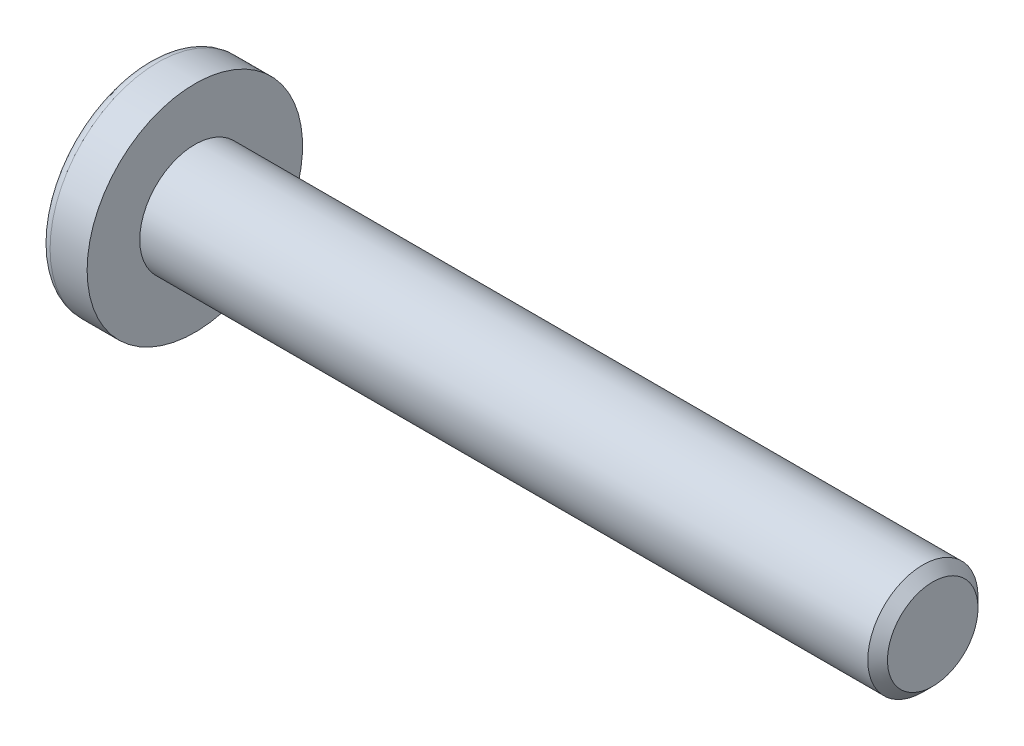
ISO-10303-21;
HEADER;
FILE_DESCRIPTION(('STEP AP214'),'2;1');
FILE_NAME('part.step','',(''),(''),'','','');
FILE_SCHEMA(('AUTOMOTIVE_DESIGN { 1 0 10303 214 1 1 1 1 }'));
ENDSEC;
DATA;
#1=APPLICATION_CONTEXT('core data for automotive mechanical design processes');
#2=APPLICATION_PROTOCOL_DEFINITION('international standard','automotive_design',2000,#1);
#3=PRODUCT_CONTEXT('',#1,'mechanical');
#4=PRODUCT('Part','Part','',(#3));
#5=PRODUCT_RELATED_PRODUCT_CATEGORY('part','',(#4));
#6=PRODUCT_DEFINITION_FORMATION('','',#4);
#7=PRODUCT_DEFINITION_CONTEXT('part definition',#1,'design');
#8=PRODUCT_DEFINITION('design','',#6,#7);
#9=PRODUCT_DEFINITION_SHAPE('','',#8);
#10=(LENGTH_UNIT() NAMED_UNIT(*) SI_UNIT(.MILLI.,.METRE.));
#11=(NAMED_UNIT(*) PLANE_ANGLE_UNIT() SI_UNIT($,.RADIAN.));
#12=(NAMED_UNIT(*) SI_UNIT($,.STERADIAN.) SOLID_ANGLE_UNIT());
#13=UNCERTAINTY_MEASURE_WITH_UNIT(LENGTH_MEASURE(1.E-05),#10,'distance_accuracy_value','');
#14=(GEOMETRIC_REPRESENTATION_CONTEXT(3) GLOBAL_UNCERTAINTY_ASSIGNED_CONTEXT((#13)) GLOBAL_UNIT_ASSIGNED_CONTEXT((#10,
#11,#12)) REPRESENTATION_CONTEXT('',''));
#15=CARTESIAN_POINT('',(0.,0.,0.));
#16=DIRECTION('',(0.,0.,1.));
#17=DIRECTION('',(1.,0.,0.));
#18=AXIS2_PLACEMENT_3D('',#15,#16,#17);
#19=CARTESIAN_POINT('',(4.55168,0.,0.));
#20=DIRECTION('',(-1.,0.,0.));
#21=DIRECTION('',(0.,1.,0.));
#22=AXIS2_PLACEMENT_3D('',#19,#20,#21);
#23=SPHERICAL_SURFACE('',#22,4.55168);
#24=CARTESIAN_POINT('',(0.870207289833468,0.,0.));
#25=DIRECTION('',(-1.,0.,0.));
#26=DIRECTION('',(0.,0.,1.));
#27=AXIS2_PLACEMENT_3D('',#24,#25,#26);
#28=CIRCLE('',#27,2.67666761229314);
#29=CARTESIAN_POINT('',(0.870207289833468,0.,2.67666761229314));
#30=VERTEX_POINT('',#29);
#31=EDGE_CURVE('E149',#30,#30,#28,.T.);
#32=ORIENTED_EDGE('',*,*,#31,.T.);
#33=EDGE_LOOP('',(#32));
#34=FACE_BOUND('',#33,.T.);
#35=CARTESIAN_POINT('',(4.54621406502776,-0.053976107850912,0.));
#36=DIRECTION('',(-0.100750553686815,-0.9949117176573,0.));
#37=DIRECTION('',(0.994911717657301,-0.100750553686815,0.));
#38=AXIS2_PLACEMENT_3D('',#35,#36,#37);
#39=CIRCLE('',#38,4.55135666870178);
#40=CARTESIAN_POINT('',(0.298280104214869,0.376194419826337,1.57634320737159));
#41=VERTEX_POINT('',#40);
#42=CARTESIAN_POINT('',(0.0357821905509195,0.402776487032817,0.402776487032818));
#43=VERTEX_POINT('',#42);
#44=EDGE_CURVE('E259',#41,#43,#39,.T.);
#45=ORIENTED_EDGE('',*,*,#44,.F.);
#46=CARTESIAN_POINT('',(3.65196023945684,0.,-1.11933639500645));
#47=DIRECTION('',(0.626498155753381,0.,0.77942290243334));
#48=DIRECTION('',(0.77942290243334,0.,-0.626498155753381));
#49=AXIS2_PLACEMENT_3D('',#46,#47,#48);
#50=CIRCLE('',#49,4.31918756361681);
#51=CARTESIAN_POINT('',(0.298280104214869,-0.376194419826348,1.57634320737159));
#52=VERTEX_POINT('',#51);
#53=EDGE_CURVE('E148',#41,#52,#50,.T.);
#54=ORIENTED_EDGE('',*,*,#53,.T.);
#55=CARTESIAN_POINT('',(4.54621406502776,0.0539761078509117,0.));
#56=DIRECTION('',(-0.100750553686815,0.9949117176573,0.));
#57=DIRECTION('',(-0.994911717657301,-0.100750553686815,0.));
#58=AXIS2_PLACEMENT_3D('',#55,#56,#57);
#59=CIRCLE('',#58,4.55135666870178);
#60=CARTESIAN_POINT('',(0.0357821905509186,-0.402776487032819,0.402776487032818));
#61=VERTEX_POINT('',#60);
#62=EDGE_CURVE('E104',#61,#52,#59,.T.);
#63=ORIENTED_EDGE('',*,*,#62,.F.);
#64=CARTESIAN_POINT('',(4.54621406502776,0.,-0.0539761078509118));
#65=DIRECTION('',(-0.100750553686815,0.,-0.9949117176573));
#66=DIRECTION('',(-0.994911717657301,0.,0.100750553686815));
#67=AXIS2_PLACEMENT_3D('',#64,#65,#66);
#68=CIRCLE('',#67,4.55135666870178);
#69=CARTESIAN_POINT('',(0.298280104214869,-1.57634320737159,0.376194419826342));
#70=VERTEX_POINT('',#69);
#71=EDGE_CURVE('E129',#70,#61,#68,.T.);
#72=ORIENTED_EDGE('',*,*,#71,.F.);
#73=CARTESIAN_POINT('',(3.65196023945684,1.11933639500645,0.));
#74=DIRECTION('',(0.626498155753381,-0.779422902433341,0.));
#75=DIRECTION('',(0.779422902433341,0.626498155753381,0.));
#76=AXIS2_PLACEMENT_3D('',#73,#74,#75);
#77=CIRCLE('',#76,4.31918756361681);
#78=CARTESIAN_POINT('',(0.298280104214869,-1.57634320737159,-0.376194419826342));
#79=VERTEX_POINT('',#78);
#80=EDGE_CURVE('E137',#70,#79,#77,.T.);
#81=ORIENTED_EDGE('',*,*,#80,.T.);
#82=CARTESIAN_POINT('',(4.54621406502776,0.,0.0539761078509119));
#83=DIRECTION('',(-0.100750553686815,0.,0.9949117176573));
#84=DIRECTION('',(0.994911717657301,0.,0.100750553686815));
#85=AXIS2_PLACEMENT_3D('',#82,#83,#84);
#86=CIRCLE('',#85,4.55135666870178);
#87=CARTESIAN_POINT('',(0.0357821905509195,-0.402776487032816,-0.402776487032818));
#88=VERTEX_POINT('',#87);
#89=EDGE_CURVE('E45',#88,#79,#86,.T.);
#90=ORIENTED_EDGE('',*,*,#89,.F.);
#91=CARTESIAN_POINT('',(0.298280104214869,-0.376194419826336,-1.57634320737159));
#92=VERTEX_POINT('',#91);
#93=EDGE_CURVE('E254',#92,#88,#59,.T.);
#94=ORIENTED_EDGE('',*,*,#93,.F.);
#95=CARTESIAN_POINT('',(3.65196023945684,0.,1.11933639500645));
#96=DIRECTION('',(0.626498155753381,0.,-0.779422902433341));
#97=DIRECTION('',(-0.779422902433341,0.,-0.626498155753381));
#98=AXIS2_PLACEMENT_3D('',#95,#96,#97);
#99=CIRCLE('',#98,4.31918756361681);
#100=CARTESIAN_POINT('',(0.298280104214869,0.376194419826348,-1.57634320737159));
#101=VERTEX_POINT('',#100);
#102=EDGE_CURVE('E130',#92,#101,#99,.T.);
#103=ORIENTED_EDGE('',*,*,#102,.T.);
#104=CARTESIAN_POINT('',(0.0357821905509195,0.40277648703282,-0.402776487032818));
#105=VERTEX_POINT('',#104);
#106=EDGE_CURVE('E264',#105,#101,#39,.T.);
#107=ORIENTED_EDGE('',*,*,#106,.F.);
#108=CARTESIAN_POINT('',(0.29828010421487,1.57634320737159,-0.376194419826342));
#109=VERTEX_POINT('',#108);
#110=EDGE_CURVE('E165',#109,#105,#86,.T.);
#111=ORIENTED_EDGE('',*,*,#110,.F.);
#112=CARTESIAN_POINT('',(3.65196023945684,-1.11933639500645,0.));
#113=DIRECTION('',(0.626498155753381,0.77942290243334,0.));
#114=DIRECTION('',(-0.77942290243334,0.626498155753381,0.));
#115=AXIS2_PLACEMENT_3D('',#112,#113,#114);
#116=CIRCLE('',#115,4.31918756361681);
#117=CARTESIAN_POINT('',(0.29828010421487,1.57634320737159,0.376194419826342));
#118=VERTEX_POINT('',#117);
#119=EDGE_CURVE('E53',#109,#118,#116,.T.);
#120=ORIENTED_EDGE('',*,*,#119,.T.);
#121=EDGE_CURVE('E163',#43,#118,#68,.T.);
#122=ORIENTED_EDGE('',*,*,#121,.F.);
#123=EDGE_LOOP('',(#45,#54,#63,#72,#81,#90,#94,#103,#107,#111,#120,#122));
#124=FACE_BOUND('',#123,.T.);
#125=ADVANCED_FACE('F30',(#34,#124),#23,.T.);
#126=CARTESIAN_POINT('',(2.2594,0.,-0.1776));
#127=DIRECTION('',(-0.100750553686815,0.,0.9949117176573));
#128=DIRECTION('',(0.994911717657301,0.,0.100750553686815));
#129=AXIS2_PLACEMENT_3D('',#126,#127,#128);
#130=PLANE('',#129);
#131=ORIENTED_EDGE('',*,*,#110,.T.);
#132=DIRECTION('',(0.989900325021556,-0.100243070888259,0.100243070888259));
#133=VECTOR('',#132,1.);
#134=CARTESIAN_POINT('',(2.27702336316533,0.175815355628828,-0.175815355628827));
#135=LINE('',#134,#133);
#136=CARTESIAN_POINT('',(2.0066,0.203200000000001,-0.203199999999999));
#137=VERTEX_POINT('',#136);
#138=EDGE_CURVE('E262',#105,#137,#135,.T.);
#139=ORIENTED_EDGE('',*,*,#138,.T.);
#140=DIRECTION('',(0.777006374114706,-0.624555756408657,0.0786841897837677));
#141=VECTOR('',#140,1.);
#142=CARTESIAN_POINT('',(0.,1.8161,-0.4064));
#143=LINE('',#142,#141);
#144=EDGE_CURVE('E153',#109,#137,#143,.T.);
#145=ORIENTED_EDGE('',*,*,#144,.F.);
#146=EDGE_LOOP('',(#131,#139,#145));
#147=FACE_BOUND('',#146,.T.);
#148=ADVANCED_FACE('F184',(#147),#130,.T.);
#149=DIRECTION('',(0.777006374114707,0.624555756408656,0.0786841897837678));
#150=VECTOR('',#149,1.);
#151=CARTESIAN_POINT('',(0.,-1.8161,-0.4064));
#152=LINE('',#151,#150);
#153=CARTESIAN_POINT('',(2.0066,-0.2032,-0.2032));
#154=VERTEX_POINT('',#153);
#155=EDGE_CURVE('E138',#79,#154,#152,.T.);
#156=ORIENTED_EDGE('',*,*,#155,.T.);
#157=DIRECTION('',(-0.989900325021556,-0.100243070888258,-0.100243070888259));
#158=VECTOR('',#157,1.);
#159=CARTESIAN_POINT('',(2.27702336316533,-0.175815355628826,-0.175815355628827));
#160=LINE('',#159,#158);
#161=EDGE_CURVE('E250',#154,#88,#160,.T.);
#162=ORIENTED_EDGE('',*,*,#161,.T.);
#163=ORIENTED_EDGE('',*,*,#89,.T.);
#164=EDGE_LOOP('',(#156,#162,#163));
#165=FACE_BOUND('',#164,.T.);
#166=ADVANCED_FACE('F190',(#165),#130,.T.);
#167=CARTESIAN_POINT('',(2.2594,0.,0.1776));
#168=DIRECTION('',(-0.100750553686815,0.,-0.9949117176573));
#169=DIRECTION('',(-0.994911717657301,0.,0.100750553686815));
#170=AXIS2_PLACEMENT_3D('',#167,#168,#169);
#171=PLANE('',#170);
#172=DIRECTION('',(0.777006374114706,-0.624555756408657,-0.0786841897837677));
#173=VECTOR('',#172,1.);
#174=CARTESIAN_POINT('',(0.,1.8161,0.4064));
#175=LINE('',#174,#173);
#176=CARTESIAN_POINT('',(2.0066,0.2032,0.2032));
#177=VERTEX_POINT('',#176);
#178=EDGE_CURVE('E243',#118,#177,#175,.T.);
#179=ORIENTED_EDGE('',*,*,#178,.T.);
#180=DIRECTION('',(-0.989900325021556,0.100243070888259,0.100243070888259));
#181=VECTOR('',#180,1.);
#182=CARTESIAN_POINT('',(2.27702336316533,0.175815355628826,0.175815355628827));
#183=LINE('',#182,#181);
#184=EDGE_CURVE('E256',#177,#43,#183,.T.);
#185=ORIENTED_EDGE('',*,*,#184,.T.);
#186=ORIENTED_EDGE('',*,*,#121,.T.);
#187=EDGE_LOOP('',(#179,#185,#186));
#188=FACE_BOUND('',#187,.T.);
#189=ADVANCED_FACE('F213',(#188),#171,.T.);
#190=ORIENTED_EDGE('',*,*,#71,.T.);
#191=DIRECTION('',(0.989900325021556,0.100243070888259,-0.100243070888259));
#192=VECTOR('',#191,1.);
#193=CARTESIAN_POINT('',(2.27702336316533,-0.175815355628828,0.175815355628827));
#194=LINE('',#193,#192);
#195=CARTESIAN_POINT('',(2.0066,-0.203200000000001,0.203199999999999));
#196=VERTEX_POINT('',#195);
#197=EDGE_CURVE('E102',#61,#196,#194,.T.);
#198=ORIENTED_EDGE('',*,*,#197,.T.);
#199=DIRECTION('',(0.777006374114707,0.624555756408656,-0.0786841897837676));
#200=VECTOR('',#199,1.);
#201=CARTESIAN_POINT('',(0.,-1.8161,0.406399999999999));
#202=LINE('',#201,#200);
#203=EDGE_CURVE('E127',#70,#196,#202,.T.);
#204=ORIENTED_EDGE('',*,*,#203,.F.);
#205=EDGE_LOOP('',(#190,#198,#204));
#206=FACE_BOUND('',#205,.T.);
#207=ADVANCED_FACE('F126',(#206),#171,.T.);
#208=CARTESIAN_POINT('',(-25.4,0.,0.));
#209=DIRECTION('',(-1.,0.,0.));
#210=DIRECTION('',(0.,0.,1.));
#211=AXIS2_PLACEMENT_3D('',#208,#209,#210);
#212=CYLINDRICAL_SURFACE('',#211,1.4224);
#213=CARTESIAN_POINT('',(20.828,0.,0.));
#214=DIRECTION('',(1.,0.,0.));
#215=DIRECTION('',(0.,0.,-1.));
#216=AXIS2_PLACEMENT_3D('',#213,#214,#215);
#217=CIRCLE('',#216,1.4224);
#218=CARTESIAN_POINT('',(20.828,0.,-1.4224));
#219=VERTEX_POINT('',#218);
#220=EDGE_CURVE('E38',#219,#219,#217,.F.);
#221=ORIENTED_EDGE('',*,*,#220,.T.);
#222=EDGE_LOOP('',(#221));
#223=FACE_BOUND('',#222,.T.);
#224=CARTESIAN_POINT('',(2.032,0.,0.));
#225=DIRECTION('',(-1.,0.,0.));
#226=DIRECTION('',(0.,0.,1.));
#227=AXIS2_PLACEMENT_3D('',#224,#225,#226);
#228=CIRCLE('',#227,1.4224);
#229=CARTESIAN_POINT('',(2.032,0.,1.4224));
#230=VERTEX_POINT('',#229);
#231=EDGE_CURVE('E159',#230,#230,#228,.T.);
#232=ORIENTED_EDGE('',*,*,#231,.F.);
#233=EDGE_LOOP('',(#232));
#234=FACE_BOUND('',#233,.T.);
#235=ADVANCED_FACE('F171',(#223,#234),#212,.T.);
#236=CARTESIAN_POINT('',(2.032,1.4224,0.));
#237=DIRECTION('',(-1.,0.,0.));
#238=DIRECTION('',(0.,0.,1.));
#239=AXIS2_PLACEMENT_3D('',#236,#237,#238);
#240=PLANE('',#239);
#241=CARTESIAN_POINT('',(2.032,0.,0.));
#242=DIRECTION('',(-1.,0.,0.));
#243=DIRECTION('',(0.,0.,1.));
#244=AXIS2_PLACEMENT_3D('',#241,#242,#243);
#245=CIRCLE('',#244,2.7813);
#246=CARTESIAN_POINT('',(2.032,0.,2.7813));
#247=VERTEX_POINT('',#246);
#248=EDGE_CURVE('E156',#247,#247,#245,.T.);
#249=ORIENTED_EDGE('',*,*,#248,.F.);
#250=EDGE_LOOP('',(#249));
#251=FACE_BOUND('',#250,.T.);
#252=ORIENTED_EDGE('',*,*,#231,.T.);
#253=EDGE_LOOP('',(#252));
#254=FACE_BOUND('',#253,.T.);
#255=ADVANCED_FACE('F205',(#251,#254),#240,.F.);
#256=CARTESIAN_POINT('',(-25.4,0.,0.));
#257=DIRECTION('',(-1.,0.,0.));
#258=DIRECTION('',(0.,0.,1.));
#259=AXIS2_PLACEMENT_3D('',#256,#257,#258);
#260=CYLINDRICAL_SURFACE('',#259,2.7813);
#261=ORIENTED_EDGE('',*,*,#248,.T.);
#262=EDGE_LOOP('',(#261));
#263=FACE_BOUND('',#262,.T.);
#264=CARTESIAN_POINT('',(1.07564661517758,0.,0.));
#265=DIRECTION('',(-1.,0.,0.));
#266=DIRECTION('',(0.,0.,1.));
#267=AXIS2_PLACEMENT_3D('',#264,#265,#266);
#268=CIRCLE('',#267,2.7813);
#269=CARTESIAN_POINT('',(1.07564661517758,0.,2.7813));
#270=VERTEX_POINT('',#269);
#271=EDGE_CURVE('E152',#270,#270,#268,.T.);
#272=ORIENTED_EDGE('',*,*,#271,.F.);
#273=EDGE_LOOP('',(#272));
#274=FACE_BOUND('',#273,.T.);
#275=ADVANCED_FACE('F201',(#263,#274),#260,.T.);
#276=CARTESIAN_POINT('',(1.07564661517758,0.,0.));
#277=DIRECTION('',(-1.,0.,0.));
#278=DIRECTION('',(0.,0.,1.));
#279=AXIS2_PLACEMENT_3D('',#276,#277,#278);
#280=TOROIDAL_SURFACE('',#279,2.5273,0.254);
#281=ORIENTED_EDGE('',*,*,#271,.T.);
#282=EDGE_LOOP('',(#281));
#283=FACE_BOUND('',#282,.T.);
#284=ORIENTED_EDGE('',*,*,#31,.F.);
#285=EDGE_LOOP('',(#284));
#286=FACE_BOUND('',#285,.T.);
#287=ADVANCED_FACE('F198',(#283,#286),#280,.T.);
#288=CARTESIAN_POINT('',(21.082,1.4224,0.));
#289=DIRECTION('',(1.,0.,0.));
#290=DIRECTION('',(0.,0.,-1.));
#291=AXIS2_PLACEMENT_3D('',#288,#289,#290);
#292=PLANE('',#291);
#293=CARTESIAN_POINT('',(21.082,0.,0.));
#294=DIRECTION('',(1.,0.,0.));
#295=DIRECTION('',(0.,0.,-1.));
#296=AXIS2_PLACEMENT_3D('',#293,#294,#295);
#297=CIRCLE('',#296,1.1684);
#298=CARTESIAN_POINT('',(21.082,0.,-1.1684));
#299=VERTEX_POINT('',#298);
#300=EDGE_CURVE('E11',#299,#299,#297,.T.);
#301=ORIENTED_EDGE('',*,*,#300,.T.);
#302=EDGE_LOOP('',(#301));
#303=FACE_BOUND('',#302,.T.);
#304=ADVANCED_FACE('F196',(#303),#292,.T.);
#305=CARTESIAN_POINT('',(2.0066,0.2032,0.2032));
#306=DIRECTION('',(0.626498155753381,0.77942290243334,0.));
#307=DIRECTION('',(-0.77942290243334,0.626498155753381,0.));
#308=AXIS2_PLACEMENT_3D('',#305,#306,#307);
#309=PLANE('',#308);
#310=ORIENTED_EDGE('',*,*,#144,.T.);
#311=DIRECTION('',(0.,0.,-1.));
#312=VECTOR('',#311,1.);
#313=CARTESIAN_POINT('',(2.0066,0.2032,0.2032));
#314=LINE('',#313,#312);
#315=EDGE_CURVE('E120',#177,#137,#314,.T.);
#316=ORIENTED_EDGE('',*,*,#315,.F.);
#317=ORIENTED_EDGE('',*,*,#178,.F.);
#318=ORIENTED_EDGE('',*,*,#119,.F.);
#319=EDGE_LOOP('',(#310,#316,#317,#318));
#320=FACE_BOUND('',#319,.T.);
#321=ADVANCED_FACE('F222',(#320),#309,.F.);
#322=CARTESIAN_POINT('',(0.,-1.8161,-0.4064));
#323=DIRECTION('',(0.626498155753381,-0.779422902433341,0.));
#324=DIRECTION('',(0.779422902433341,0.626498155753381,0.));
#325=AXIS2_PLACEMENT_3D('',#322,#323,#324);
#326=PLANE('',#325);
#327=ORIENTED_EDGE('',*,*,#203,.T.);
#328=DIRECTION('',(0.,0.,1.));
#329=VECTOR('',#328,1.);
#330=CARTESIAN_POINT('',(2.0066,-0.2032,-0.2032));
#331=LINE('',#330,#329);
#332=EDGE_CURVE('E119',#154,#196,#331,.T.);
#333=ORIENTED_EDGE('',*,*,#332,.F.);
#334=ORIENTED_EDGE('',*,*,#155,.F.);
#335=ORIENTED_EDGE('',*,*,#80,.F.);
#336=EDGE_LOOP('',(#327,#333,#334,#335));
#337=FACE_BOUND('',#336,.T.);
#338=ADVANCED_FACE('F134',(#337),#326,.F.);
#339=CARTESIAN_POINT('',(2.0066,0.2032,-0.2032));
#340=DIRECTION('',(-1.,0.,0.));
#341=DIRECTION('',(0.,0.,1.));
#342=AXIS2_PLACEMENT_3D('',#339,#340,#341);
#343=PLANE('',#342);
#344=DIRECTION('',(0.,1.,0.));
#345=VECTOR('',#344,1.);
#346=CARTESIAN_POINT('',(2.0066,-0.2032,-0.2032));
#347=LINE('',#346,#345);
#348=EDGE_CURVE('E142',#154,#137,#347,.T.);
#349=ORIENTED_EDGE('',*,*,#348,.F.);
#350=ORIENTED_EDGE('',*,*,#332,.T.);
#351=DIRECTION('',(0.,-1.,0.));
#352=VECTOR('',#351,1.);
#353=CARTESIAN_POINT('',(2.0066,0.2032,0.2032));
#354=LINE('',#353,#352);
#355=EDGE_CURVE('E111',#177,#196,#354,.T.);
#356=ORIENTED_EDGE('',*,*,#355,.F.);
#357=ORIENTED_EDGE('',*,*,#315,.T.);
#358=EDGE_LOOP('',(#349,#350,#356,#357));
#359=FACE_BOUND('',#358,.T.);
#360=ADVANCED_FACE('F140',(#359),#343,.T.);
#361=CARTESIAN_POINT('',(0.,0.406400000000006,-1.8161));
#362=DIRECTION('',(0.626498155753381,0.,-0.779422902433341));
#363=DIRECTION('',(0.779422902433341,0.,0.626498155753381));
#364=AXIS2_PLACEMENT_3D('',#361,#362,#363);
#365=PLANE('',#364);
#366=DIRECTION('',(0.777006374114707,0.0786841897837654,0.624555756408656));
#367=VECTOR('',#366,1.);
#368=CARTESIAN_POINT('',(0.,-0.406399999999993,-1.8161));
#369=LINE('',#368,#367);
#370=EDGE_CURVE('E269',#92,#154,#369,.T.);
#371=ORIENTED_EDGE('',*,*,#370,.T.);
#372=ORIENTED_EDGE('',*,*,#348,.T.);
#373=DIRECTION('',(0.777006374114707,-0.0786841897837699,0.624555756408656));
#374=VECTOR('',#373,1.);
#375=CARTESIAN_POINT('',(0.,0.406400000000006,-1.8161));
#376=LINE('',#375,#374);
#377=EDGE_CURVE('E108',#101,#137,#376,.T.);
#378=ORIENTED_EDGE('',*,*,#377,.F.);
#379=ORIENTED_EDGE('',*,*,#102,.F.);
#380=EDGE_LOOP('',(#371,#372,#378,#379));
#381=FACE_BOUND('',#380,.T.);
#382=ADVANCED_FACE('F224',(#381),#365,.F.);
#383=CARTESIAN_POINT('',(2.2594,-0.1776,0.));
#384=DIRECTION('',(-0.100750553686815,0.9949117176573,0.));
#385=DIRECTION('',(-0.994911717657301,-0.100750553686815,0.));
#386=AXIS2_PLACEMENT_3D('',#383,#384,#385);
#387=PLANE('',#386);
#388=ORIENTED_EDGE('',*,*,#93,.T.);
#389=ORIENTED_EDGE('',*,*,#161,.F.);
#390=ORIENTED_EDGE('',*,*,#370,.F.);
#391=EDGE_LOOP('',(#388,#389,#390));
#392=FACE_BOUND('',#391,.T.);
#393=ADVANCED_FACE('F181',(#392),#387,.T.);
#394=CARTESIAN_POINT('',(2.2594,0.1776,0.));
#395=DIRECTION('',(-0.100750553686815,-0.9949117176573,0.));
#396=DIRECTION('',(0.994911717657301,-0.100750553686815,0.));
#397=AXIS2_PLACEMENT_3D('',#394,#395,#396);
#398=PLANE('',#397);
#399=ORIENTED_EDGE('',*,*,#106,.T.);
#400=ORIENTED_EDGE('',*,*,#377,.T.);
#401=ORIENTED_EDGE('',*,*,#138,.F.);
#402=EDGE_LOOP('',(#399,#400,#401));
#403=FACE_BOUND('',#402,.T.);
#404=ADVANCED_FACE('F233',(#403),#398,.T.);
#405=CARTESIAN_POINT('',(2.0066,-0.203200000000001,0.203199999999999));
#406=DIRECTION('',(0.626498155753381,0.,0.77942290243334));
#407=DIRECTION('',(-0.77942290243334,0.,0.626498155753381));
#408=AXIS2_PLACEMENT_3D('',#405,#406,#407);
#409=PLANE('',#408);
#410=DIRECTION('',(0.777006374114706,-0.0786841897837656,-0.624555756408657));
#411=VECTOR('',#410,1.);
#412=CARTESIAN_POINT('',(0.,0.406399999999994,1.8161));
#413=LINE('',#412,#411);
#414=EDGE_CURVE('E107',#41,#177,#413,.T.);
#415=ORIENTED_EDGE('',*,*,#414,.T.);
#416=ORIENTED_EDGE('',*,*,#355,.T.);
#417=DIRECTION('',(0.777006374114706,0.0786841897837699,-0.624555756408656));
#418=VECTOR('',#417,1.);
#419=CARTESIAN_POINT('',(0.,-0.406400000000006,1.8161));
#420=LINE('',#419,#418);
#421=EDGE_CURVE('E98',#52,#196,#420,.T.);
#422=ORIENTED_EDGE('',*,*,#421,.F.);
#423=ORIENTED_EDGE('',*,*,#53,.F.);
#424=EDGE_LOOP('',(#415,#416,#422,#423));
#425=FACE_BOUND('',#424,.T.);
#426=ADVANCED_FACE('F112',(#425),#409,.F.);
#427=ORIENTED_EDGE('',*,*,#44,.T.);
#428=ORIENTED_EDGE('',*,*,#184,.F.);
#429=ORIENTED_EDGE('',*,*,#414,.F.);
#430=EDGE_LOOP('',(#427,#428,#429));
#431=FACE_BOUND('',#430,.T.);
#432=ADVANCED_FACE('F179',(#431),#398,.T.);
#433=ORIENTED_EDGE('',*,*,#62,.T.);
#434=ORIENTED_EDGE('',*,*,#421,.T.);
#435=ORIENTED_EDGE('',*,*,#197,.F.);
#436=EDGE_LOOP('',(#433,#434,#435));
#437=FACE_BOUND('',#436,.T.);
#438=ADVANCED_FACE('F100',(#437),#387,.T.);
#439=CARTESIAN_POINT('',(20.828,0.,0.));
#440=DIRECTION('',(-1.,0.,0.));
#441=DIRECTION('',(0.,0.,1.));
#442=AXIS2_PLACEMENT_3D('',#439,#440,#441);
#443=CONICAL_SURFACE('',#442,1.4224,0.785398163397446);
#444=ORIENTED_EDGE('',*,*,#300,.F.);
#445=EDGE_LOOP('',(#444));
#446=FACE_BOUND('',#445,.T.);
#447=ORIENTED_EDGE('',*,*,#220,.F.);
#448=EDGE_LOOP('',(#447));
#449=FACE_BOUND('',#448,.T.);
#450=ADVANCED_FACE('F32',(#446,#449),#443,.T.);
#451=CLOSED_SHELL('',(#125,#148,#166,#189,#207,#235,#255,#275,#287,#304,#321,#338,#360,#382,
#393,#404,#426,#432,#438,#450));
#452=MANIFOLD_SOLID_BREP('B2',#451);
#453=ADVANCED_BREP_SHAPE_REPRESENTATION('',(#18,#452),#14);
#454=SHAPE_DEFINITION_REPRESENTATION(#9,#453);
ENDSEC;
END-ISO-10303-21;
